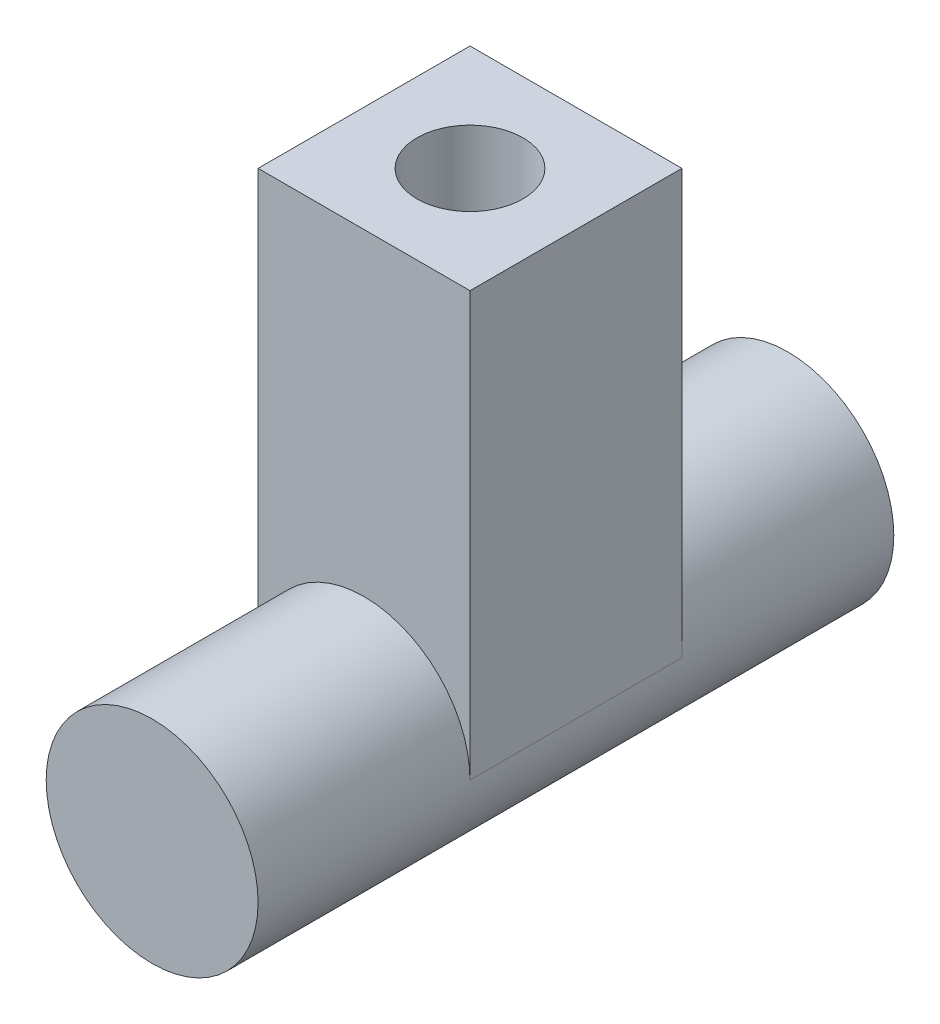
ISO-10303-21;
HEADER;
FILE_DESCRIPTION(('STEP AP214'),'2;1');
FILE_NAME('part.step','',(''),(''),'','','');
FILE_SCHEMA(('AUTOMOTIVE_DESIGN { 1 0 10303 214 1 1 1 1 }'));
ENDSEC;
DATA;
#1=APPLICATION_CONTEXT('core data for automotive mechanical design processes');
#2=APPLICATION_PROTOCOL_DEFINITION('international standard','automotive_design',2000,#1);
#3=PRODUCT_CONTEXT('',#1,'mechanical');
#4=PRODUCT('Part','Part','',(#3));
#5=PRODUCT_RELATED_PRODUCT_CATEGORY('part','',(#4));
#6=PRODUCT_DEFINITION_FORMATION('','',#4);
#7=PRODUCT_DEFINITION_CONTEXT('part definition',#1,'design');
#8=PRODUCT_DEFINITION('design','',#6,#7);
#9=PRODUCT_DEFINITION_SHAPE('','',#8);
#10=(LENGTH_UNIT() NAMED_UNIT(*) SI_UNIT(.MILLI.,.METRE.));
#11=(NAMED_UNIT(*) PLANE_ANGLE_UNIT() SI_UNIT($,.RADIAN.));
#12=(NAMED_UNIT(*) SI_UNIT($,.STERADIAN.) SOLID_ANGLE_UNIT());
#13=UNCERTAINTY_MEASURE_WITH_UNIT(LENGTH_MEASURE(1.E-05),#10,'distance_accuracy_value','');
#14=(GEOMETRIC_REPRESENTATION_CONTEXT(3) GLOBAL_UNCERTAINTY_ASSIGNED_CONTEXT((#13)) GLOBAL_UNIT_ASSIGNED_CONTEXT((#10,
#11,#12)) REPRESENTATION_CONTEXT('',''));
#15=CARTESIAN_POINT('',(0.,0.,0.));
#16=DIRECTION('',(0.,0.,1.));
#17=DIRECTION('',(1.,0.,0.));
#18=AXIS2_PLACEMENT_3D('',#15,#16,#17);
#19=CARTESIAN_POINT('',(0.,0.,30.));
#20=DIRECTION('',(0.,0.,-1.));
#21=DIRECTION('',(-1.,0.,0.));
#22=AXIS2_PLACEMENT_3D('',#19,#20,#21);
#23=CYLINDRICAL_SURFACE('',#22,10.);
#24=CARTESIAN_POINT('',(0.,0.,-30.));
#25=DIRECTION('',(0.,0.,1.));
#26=DIRECTION('',(1.,0.,0.));
#27=AXIS2_PLACEMENT_3D('',#24,#25,#26);
#28=CIRCLE('',#27,10.);
#29=CARTESIAN_POINT('',(10.,0.,-30.));
#30=VERTEX_POINT('',#29);
#31=EDGE_CURVE('E107',#30,#30,#28,.T.);
#32=ORIENTED_EDGE('',*,*,#31,.T.);
#33=EDGE_LOOP('',(#32));
#34=FACE_BOUND('',#33,.T.);
#35=CARTESIAN_POINT('',(0.,0.,30.));
#36=DIRECTION('',(0.,0.,1.));
#37=DIRECTION('',(1.,0.,0.));
#38=AXIS2_PLACEMENT_3D('',#35,#36,#37);
#39=CIRCLE('',#38,10.);
#40=CARTESIAN_POINT('',(10.,0.,30.));
#41=VERTEX_POINT('',#40);
#42=EDGE_CURVE('E112',#41,#41,#39,.T.);
#43=ORIENTED_EDGE('',*,*,#42,.F.);
#44=EDGE_LOOP('',(#43));
#45=FACE_BOUND('',#44,.T.);
#46=CARTESIAN_POINT('',(0.,0.,-10.));
#47=DIRECTION('',(0.,0.,1.));
#48=DIRECTION('',(1.,0.,0.));
#49=AXIS2_PLACEMENT_3D('',#46,#47,#48);
#50=CIRCLE('',#49,10.);
#51=CARTESIAN_POINT('',(10.,0.,-10.));
#52=VERTEX_POINT('',#51);
#53=CARTESIAN_POINT('',(-10.,0.,-10.));
#54=VERTEX_POINT('',#53);
#55=EDGE_CURVE('E11',#52,#54,#50,.T.);
#56=ORIENTED_EDGE('',*,*,#55,.F.);
#57=DIRECTION('',(0.,0.,-1.));
#58=VECTOR('',#57,1.);
#59=CARTESIAN_POINT('',(10.,0.,-10.));
#60=LINE('',#59,#58);
#61=CARTESIAN_POINT('',(10.,0.,10.));
#62=VERTEX_POINT('',#61);
#63=EDGE_CURVE('E63',#62,#52,#60,.T.);
#64=ORIENTED_EDGE('',*,*,#63,.F.);
#65=CARTESIAN_POINT('',(0.,0.,10.));
#66=DIRECTION('',(0.,0.,-1.));
#67=DIRECTION('',(-1.,0.,0.));
#68=AXIS2_PLACEMENT_3D('',#65,#66,#67);
#69=CIRCLE('',#68,10.);
#70=CARTESIAN_POINT('',(-10.,0.,10.));
#71=VERTEX_POINT('',#70);
#72=EDGE_CURVE('E53',#71,#62,#69,.T.);
#73=ORIENTED_EDGE('',*,*,#72,.F.);
#74=DIRECTION('',(0.,0.,1.));
#75=VECTOR('',#74,1.);
#76=CARTESIAN_POINT('',(-10.,0.,-10.));
#77=LINE('',#76,#75);
#78=EDGE_CURVE('E103',#54,#71,#77,.T.);
#79=ORIENTED_EDGE('',*,*,#78,.F.);
#80=EDGE_LOOP('',(#56,#64,#73,#79));
#81=FACE_BOUND('',#80,.T.);
#82=ADVANCED_FACE('F45',(#34,#45,#81),#23,.T.);
#83=CARTESIAN_POINT('',(0.,0.,30.));
#84=DIRECTION('',(0.,0.,1.));
#85=DIRECTION('',(1.,0.,0.));
#86=AXIS2_PLACEMENT_3D('',#83,#84,#85);
#87=PLANE('',#86);
#88=ORIENTED_EDGE('',*,*,#42,.T.);
#89=EDGE_LOOP('',(#88));
#90=FACE_BOUND('',#89,.T.);
#91=ADVANCED_FACE('F164',(#90),#87,.T.);
#92=CARTESIAN_POINT('',(0.,0.,-30.));
#93=DIRECTION('',(0.,0.,1.));
#94=DIRECTION('',(1.,0.,0.));
#95=AXIS2_PLACEMENT_3D('',#92,#93,#94);
#96=PLANE('',#95);
#97=ORIENTED_EDGE('',*,*,#31,.F.);
#98=EDGE_LOOP('',(#97));
#99=FACE_BOUND('',#98,.T.);
#100=ADVANCED_FACE('F171',(#99),#96,.F.);
#101=CARTESIAN_POINT('',(10.,40.,-10.));
#102=DIRECTION('',(-1.,0.,0.));
#103=DIRECTION('',(0.,0.,1.));
#104=AXIS2_PLACEMENT_3D('',#101,#102,#103);
#105=PLANE('',#104);
#106=ORIENTED_EDGE('',*,*,#63,.T.);
#107=DIRECTION('',(0.,-1.,0.));
#108=VECTOR('',#107,1.);
#109=CARTESIAN_POINT('',(10.,40.,-10.));
#110=LINE('',#109,#108);
#111=CARTESIAN_POINT('',(10.,40.,-10.));
#112=VERTEX_POINT('',#111);
#113=EDGE_CURVE('E86',#112,#52,#110,.T.);
#114=ORIENTED_EDGE('',*,*,#113,.F.);
#115=DIRECTION('',(0.,0.,-1.));
#116=VECTOR('',#115,1.);
#117=CARTESIAN_POINT('',(10.,40.,-10.));
#118=LINE('',#117,#116);
#119=CARTESIAN_POINT('',(10.,40.,10.));
#120=VERTEX_POINT('',#119);
#121=EDGE_CURVE('E93',#120,#112,#118,.T.);
#122=ORIENTED_EDGE('',*,*,#121,.F.);
#123=DIRECTION('',(0.,-1.,0.));
#124=VECTOR('',#123,1.);
#125=CARTESIAN_POINT('',(10.,40.,10.));
#126=LINE('',#125,#124);
#127=EDGE_CURVE('E124',#120,#62,#126,.T.);
#128=ORIENTED_EDGE('',*,*,#127,.T.);
#129=EDGE_LOOP('',(#106,#114,#122,#128));
#130=FACE_BOUND('',#129,.T.);
#131=ADVANCED_FACE('F105',(#130),#105,.F.);
#132=CARTESIAN_POINT('',(-10.,40.,-10.));
#133=DIRECTION('',(0.,0.,1.));
#134=DIRECTION('',(1.,0.,0.));
#135=AXIS2_PLACEMENT_3D('',#132,#133,#134);
#136=PLANE('',#135);
#137=ORIENTED_EDGE('',*,*,#113,.T.);
#138=ORIENTED_EDGE('',*,*,#55,.T.);
#139=DIRECTION('',(0.,-1.,0.));
#140=VECTOR('',#139,1.);
#141=CARTESIAN_POINT('',(-10.,40.,-10.));
#142=LINE('',#141,#140);
#143=CARTESIAN_POINT('',(-10.,40.,-10.));
#144=VERTEX_POINT('',#143);
#145=EDGE_CURVE('E88',#144,#54,#142,.T.);
#146=ORIENTED_EDGE('',*,*,#145,.F.);
#147=DIRECTION('',(-1.,0.,0.));
#148=VECTOR('',#147,1.);
#149=CARTESIAN_POINT('',(-10.,40.,-10.));
#150=LINE('',#149,#148);
#151=EDGE_CURVE('E82',#112,#144,#150,.T.);
#152=ORIENTED_EDGE('',*,*,#151,.F.);
#153=EDGE_LOOP('',(#137,#138,#146,#152));
#154=FACE_BOUND('',#153,.T.);
#155=ADVANCED_FACE('F84',(#154),#136,.F.);
#156=CARTESIAN_POINT('',(-10.,40.,-10.));
#157=DIRECTION('',(1.,0.,0.));
#158=DIRECTION('',(0.,0.,-1.));
#159=AXIS2_PLACEMENT_3D('',#156,#157,#158);
#160=PLANE('',#159);
#161=ORIENTED_EDGE('',*,*,#78,.T.);
#162=DIRECTION('',(0.,-1.,0.));
#163=VECTOR('',#162,1.);
#164=CARTESIAN_POINT('',(-10.,40.,10.));
#165=LINE('',#164,#163);
#166=CARTESIAN_POINT('',(-10.,40.,10.));
#167=VERTEX_POINT('',#166);
#168=EDGE_CURVE('E114',#167,#71,#165,.T.);
#169=ORIENTED_EDGE('',*,*,#168,.F.);
#170=DIRECTION('',(0.,0.,1.));
#171=VECTOR('',#170,1.);
#172=CARTESIAN_POINT('',(-10.,40.,-10.));
#173=LINE('',#172,#171);
#174=EDGE_CURVE('E92',#144,#167,#173,.T.);
#175=ORIENTED_EDGE('',*,*,#174,.F.);
#176=ORIENTED_EDGE('',*,*,#145,.T.);
#177=EDGE_LOOP('',(#161,#169,#175,#176));
#178=FACE_BOUND('',#177,.T.);
#179=ADVANCED_FACE('F161',(#178),#160,.F.);
#180=CARTESIAN_POINT('',(-10.,40.,10.));
#181=DIRECTION('',(0.,0.,-1.));
#182=DIRECTION('',(-1.,0.,0.));
#183=AXIS2_PLACEMENT_3D('',#180,#181,#182);
#184=PLANE('',#183);
#185=ORIENTED_EDGE('',*,*,#168,.T.);
#186=ORIENTED_EDGE('',*,*,#72,.T.);
#187=ORIENTED_EDGE('',*,*,#127,.F.);
#188=DIRECTION('',(1.,0.,0.));
#189=VECTOR('',#188,1.);
#190=CARTESIAN_POINT('',(-10.,40.,10.));
#191=LINE('',#190,#189);
#192=EDGE_CURVE('E98',#167,#120,#191,.T.);
#193=ORIENTED_EDGE('',*,*,#192,.F.);
#194=EDGE_LOOP('',(#185,#186,#187,#193));
#195=FACE_BOUND('',#194,.T.);
#196=ADVANCED_FACE('F123',(#195),#184,.F.);
#197=CARTESIAN_POINT('',(0.,40.,0.));
#198=DIRECTION('',(0.,1.,0.));
#199=DIRECTION('',(0.,0.,1.));
#200=AXIS2_PLACEMENT_3D('',#197,#198,#199);
#201=PLANE('',#200);
#202=CARTESIAN_POINT('',(0.,40.,0.));
#203=DIRECTION('',(0.,1.,0.));
#204=DIRECTION('',(0.,0.,1.));
#205=AXIS2_PLACEMENT_3D('',#202,#203,#204);
#206=CIRCLE('',#205,5.);
#207=CARTESIAN_POINT('',(0.,40.,5.));
#208=VERTEX_POINT('',#207);
#209=EDGE_CURVE('E140',#208,#208,#206,.T.);
#210=ORIENTED_EDGE('',*,*,#209,.F.);
#211=EDGE_LOOP('',(#210));
#212=FACE_BOUND('',#211,.T.);
#213=ORIENTED_EDGE('',*,*,#121,.T.);
#214=ORIENTED_EDGE('',*,*,#151,.T.);
#215=ORIENTED_EDGE('',*,*,#174,.T.);
#216=ORIENTED_EDGE('',*,*,#192,.T.);
#217=EDGE_LOOP('',(#213,#214,#215,#216));
#218=FACE_BOUND('',#217,.T.);
#219=ADVANCED_FACE('F96',(#212,#218),#201,.T.);
#220=CARTESIAN_POINT('',(0.,30.,0.));
#221=DIRECTION('',(0.,1.,0.));
#222=DIRECTION('',(0.,0.,1.));
#223=AXIS2_PLACEMENT_3D('',#220,#221,#222);
#224=CYLINDRICAL_SURFACE('',#223,5.);
#225=CARTESIAN_POINT('',(0.,30.,0.));
#226=DIRECTION('',(0.,1.,0.));
#227=DIRECTION('',(0.,0.,1.));
#228=AXIS2_PLACEMENT_3D('',#225,#226,#227);
#229=CIRCLE('',#228,5.);
#230=CARTESIAN_POINT('',(0.,30.,5.));
#231=VERTEX_POINT('',#230);
#232=EDGE_CURVE('E136',#231,#231,#229,.T.);
#233=ORIENTED_EDGE('',*,*,#232,.F.);
#234=EDGE_LOOP('',(#233));
#235=FACE_BOUND('',#234,.T.);
#236=ORIENTED_EDGE('',*,*,#209,.T.);
#237=EDGE_LOOP('',(#236));
#238=FACE_BOUND('',#237,.T.);
#239=ADVANCED_FACE('F150',(#235,#238),#224,.F.);
#240=CARTESIAN_POINT('',(0.,30.,0.));
#241=DIRECTION('',(0.,1.,0.));
#242=DIRECTION('',(0.,0.,1.));
#243=AXIS2_PLACEMENT_3D('',#240,#241,#242);
#244=PLANE('',#243);
#245=ORIENTED_EDGE('',*,*,#232,.T.);
#246=EDGE_LOOP('',(#245));
#247=FACE_BOUND('',#246,.T.);
#248=ADVANCED_FACE('F148',(#247),#244,.T.);
#249=CLOSED_SHELL('',(#82,#91,#100,#131,#155,#179,#196,#219,#239,#248));
#250=MANIFOLD_SOLID_BREP('B2',#249);
#251=ADVANCED_BREP_SHAPE_REPRESENTATION('',(#18,#250),#14);
#252=SHAPE_DEFINITION_REPRESENTATION(#9,#251);
ENDSEC;
END-ISO-10303-21;
